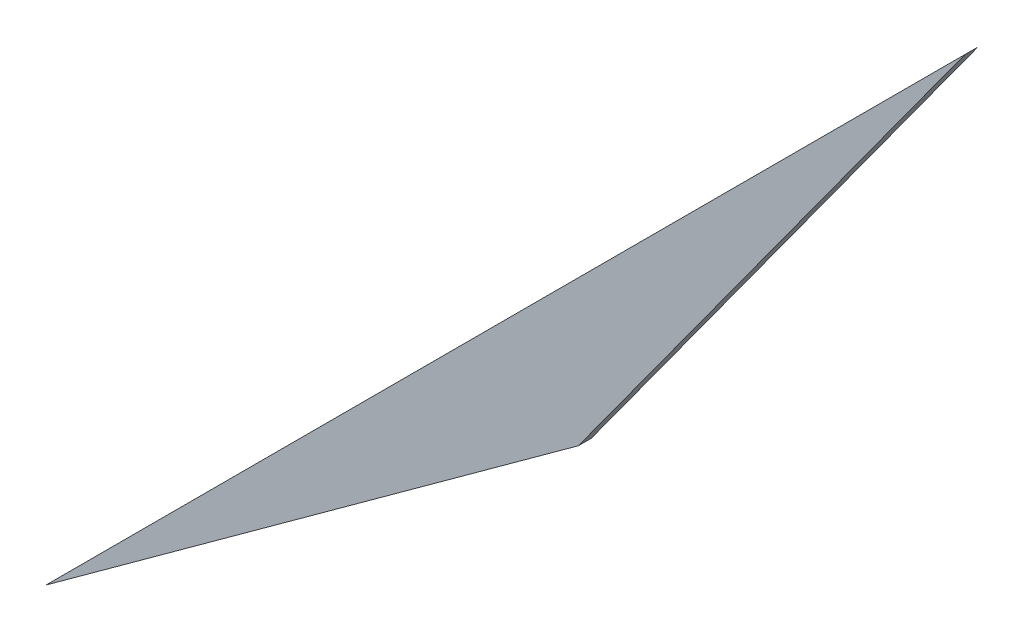
ISO-10303-21;
HEADER;
FILE_DESCRIPTION(('STEP AP214'),'2;1');
FILE_NAME('part.step','',(''),(''),'','','');
FILE_SCHEMA(('AUTOMOTIVE_DESIGN { 1 0 10303 214 1 1 1 1 }'));
ENDSEC;
DATA;
#1=APPLICATION_CONTEXT('core data for automotive mechanical design processes');
#2=APPLICATION_PROTOCOL_DEFINITION('international standard','automotive_design',2000,#1);
#3=PRODUCT_CONTEXT('',#1,'mechanical');
#4=PRODUCT('Part','Part','',(#3));
#5=PRODUCT_RELATED_PRODUCT_CATEGORY('part','',(#4));
#6=PRODUCT_DEFINITION_FORMATION('','',#4);
#7=PRODUCT_DEFINITION_CONTEXT('part definition',#1,'design');
#8=PRODUCT_DEFINITION('design','',#6,#7);
#9=PRODUCT_DEFINITION_SHAPE('','',#8);
#10=(LENGTH_UNIT() NAMED_UNIT(*) SI_UNIT(.MILLI.,.METRE.));
#11=(NAMED_UNIT(*) PLANE_ANGLE_UNIT() SI_UNIT($,.RADIAN.));
#12=(NAMED_UNIT(*) SI_UNIT($,.STERADIAN.) SOLID_ANGLE_UNIT());
#13=UNCERTAINTY_MEASURE_WITH_UNIT(LENGTH_MEASURE(1.E-05),#10,'distance_accuracy_value','');
#14=(GEOMETRIC_REPRESENTATION_CONTEXT(3) GLOBAL_UNCERTAINTY_ASSIGNED_CONTEXT((#13)) GLOBAL_UNIT_ASSIGNED_CONTEXT((#10,
#11,#12)) REPRESENTATION_CONTEXT('',''));
#15=CARTESIAN_POINT('',(0.,0.,0.));
#16=DIRECTION('',(0.,0.,1.));
#17=DIRECTION('',(1.,0.,0.));
#18=AXIS2_PLACEMENT_3D('',#15,#16,#17);
#19=CARTESIAN_POINT('',(-145.779690358274,372.576113104551,3.175));
#20=DIRECTION('',(0.707106781186551,-0.707106781186544,0.));
#21=DIRECTION('',(0.707106781186544,0.707106781186551,0.));
#22=AXIS2_PLACEMENT_3D('',#19,#20,#21);
#23=PLANE('',#22);
#24=DIRECTION('',(-0.707106781186544,-0.707106781186551,0.));
#25=VECTOR('',#24,1.);
#26=CARTESIAN_POINT('',(-145.779690358274,372.576113104551,0.));
#27=LINE('',#26,#25);
#28=CARTESIAN_POINT('',(-145.779690358274,372.576113104551,0.));
#29=VERTEX_POINT('',#28);
#30=CARTESIAN_POINT('',(-372.576113104554,145.77969035827,0.));
#31=VERTEX_POINT('',#30);
#32=EDGE_CURVE('E62',#29,#31,#27,.T.);
#33=ORIENTED_EDGE('',*,*,#32,.T.);
#34=DIRECTION('',(0.,0.,-1.));
#35=VECTOR('',#34,1.);
#36=CARTESIAN_POINT('',(-372.576113104554,145.77969035827,3.175));
#37=LINE('',#36,#35);
#38=CARTESIAN_POINT('',(-372.576113104554,145.77969035827,3.175));
#39=VERTEX_POINT('',#38);
#40=EDGE_CURVE('E11',#39,#31,#37,.T.);
#41=ORIENTED_EDGE('',*,*,#40,.F.);
#42=DIRECTION('',(-0.707106781186544,-0.707106781186551,0.));
#43=VECTOR('',#42,1.);
#44=CARTESIAN_POINT('',(-145.779690358274,372.576113104551,3.175));
#45=LINE('',#44,#43);
#46=CARTESIAN_POINT('',(-145.779690358274,372.576113104551,3.175));
#47=VERTEX_POINT('',#46);
#48=EDGE_CURVE('E76',#47,#39,#45,.T.);
#49=ORIENTED_EDGE('',*,*,#48,.F.);
#50=DIRECTION('',(0.,0.,-1.));
#51=VECTOR('',#50,1.);
#52=CARTESIAN_POINT('',(-145.779690358274,372.576113104551,3.175));
#53=LINE('',#52,#51);
#54=EDGE_CURVE('E72',#47,#29,#53,.T.);
#55=ORIENTED_EDGE('',*,*,#54,.T.);
#56=EDGE_LOOP('',(#33,#41,#49,#55));
#57=FACE_BOUND('',#56,.T.);
#58=ADVANCED_FACE('F26',(#57),#23,.F.);
#59=CARTESIAN_POINT('',(-372.576113104554,145.77969035827,3.175));
#60=DIRECTION('',(-0.587785252292477,0.809016994374945,0.));
#61=DIRECTION('',(-0.809016994374945,-0.587785252292477,0.));
#62=AXIS2_PLACEMENT_3D('',#59,#60,#61);
#63=PLANE('',#62);
#64=DIRECTION('',(0.809016994374945,0.587785252292477,0.));
#65=VECTOR('',#64,1.);
#66=CARTESIAN_POINT('',(-372.576113104554,145.77969035827,0.));
#67=LINE('',#66,#65);
#68=CARTESIAN_POINT('',(-241.217389489276,241.217389489273,0.));
#69=VERTEX_POINT('',#68);
#70=EDGE_CURVE('E59',#31,#69,#67,.T.);
#71=ORIENTED_EDGE('',*,*,#70,.T.);
#72=DIRECTION('',(0.,0.,-1.));
#73=VECTOR('',#72,1.);
#74=CARTESIAN_POINT('',(-241.217389489276,241.217389489273,3.175));
#75=LINE('',#74,#73);
#76=CARTESIAN_POINT('',(-241.217389489276,241.217389489273,3.175));
#77=VERTEX_POINT('',#76);
#78=EDGE_CURVE('E33',#77,#69,#75,.T.);
#79=ORIENTED_EDGE('',*,*,#78,.F.);
#80=DIRECTION('',(0.809016994374945,0.587785252292477,0.));
#81=VECTOR('',#80,1.);
#82=CARTESIAN_POINT('',(-372.576113104554,145.77969035827,3.175));
#83=LINE('',#82,#81);
#84=EDGE_CURVE('E44',#39,#77,#83,.T.);
#85=ORIENTED_EDGE('',*,*,#84,.F.);
#86=ORIENTED_EDGE('',*,*,#40,.T.);
#87=EDGE_LOOP('',(#71,#79,#85,#86));
#88=FACE_BOUND('',#87,.T.);
#89=ADVANCED_FACE('F68',(#88),#63,.F.);
#90=CARTESIAN_POINT('',(-241.217389489276,241.217389489273,3.175));
#91=DIRECTION('',(-0.809016994374951,0.587785252292469,0.));
#92=DIRECTION('',(-0.587785252292469,-0.809016994374951,0.));
#93=AXIS2_PLACEMENT_3D('',#90,#91,#92);
#94=PLANE('',#93);
#95=DIRECTION('',(0.587785252292469,0.809016994374951,0.));
#96=VECTOR('',#95,1.);
#97=CARTESIAN_POINT('',(-241.217389489276,241.217389489273,0.));
#98=LINE('',#97,#96);
#99=EDGE_CURVE('E63',#69,#29,#98,.T.);
#100=ORIENTED_EDGE('',*,*,#99,.T.);
#101=ORIENTED_EDGE('',*,*,#54,.F.);
#102=DIRECTION('',(0.587785252292469,0.809016994374951,0.));
#103=VECTOR('',#102,1.);
#104=CARTESIAN_POINT('',(-241.217389489276,241.217389489273,3.175));
#105=LINE('',#104,#103);
#106=EDGE_CURVE('E40',#77,#47,#105,.T.);
#107=ORIENTED_EDGE('',*,*,#106,.F.);
#108=ORIENTED_EDGE('',*,*,#78,.T.);
#109=EDGE_LOOP('',(#100,#101,#107,#108));
#110=FACE_BOUND('',#109,.T.);
#111=ADVANCED_FACE('F81',(#110),#94,.F.);
#112=CARTESIAN_POINT('',(-372.576113104555,145.779690358269,3.175));
#113=DIRECTION('',(0.,0.,1.));
#114=DIRECTION('',(1.,0.,0.));
#115=AXIS2_PLACEMENT_3D('',#112,#113,#114);
#116=PLANE('',#115);
#117=ORIENTED_EDGE('',*,*,#48,.T.);
#118=ORIENTED_EDGE('',*,*,#84,.T.);
#119=ORIENTED_EDGE('',*,*,#106,.T.);
#120=EDGE_LOOP('',(#117,#118,#119));
#121=FACE_BOUND('',#120,.T.);
#122=ADVANCED_FACE('F82',(#121),#116,.T.);
#123=CARTESIAN_POINT('',(-372.576113104555,145.779690358269,0.));
#124=DIRECTION('',(0.,0.,1.));
#125=DIRECTION('',(1.,0.,0.));
#126=AXIS2_PLACEMENT_3D('',#123,#124,#125);
#127=PLANE('',#126);
#128=ORIENTED_EDGE('',*,*,#32,.F.);
#129=ORIENTED_EDGE('',*,*,#99,.F.);
#130=ORIENTED_EDGE('',*,*,#70,.F.);
#131=EDGE_LOOP('',(#128,#129,#130));
#132=FACE_BOUND('',#131,.T.);
#133=ADVANCED_FACE('F60',(#132),#127,.F.);
#134=CLOSED_SHELL('',(#58,#89,#111,#122,#133));
#135=MANIFOLD_SOLID_BREP('B2',#134);
#136=ADVANCED_BREP_SHAPE_REPRESENTATION('',(#18,#135),#14);
#137=SHAPE_DEFINITION_REPRESENTATION(#9,#136);
ENDSEC;
END-ISO-10303-21;
